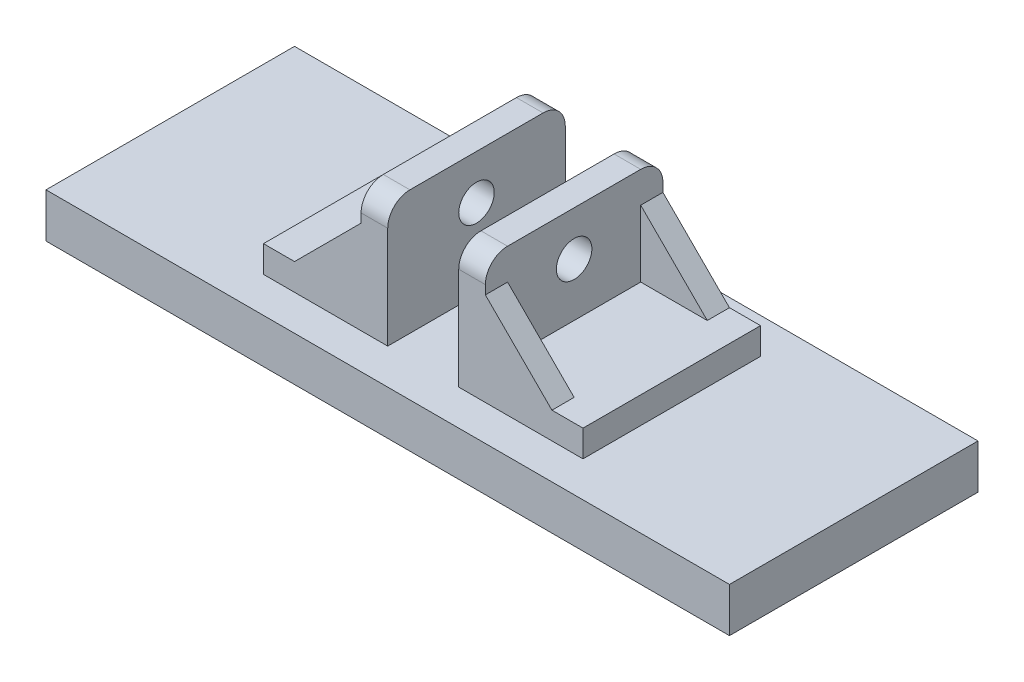
ISO-10303-21;
HEADER;
FILE_DESCRIPTION(('STEP AP214'),'2;1');
FILE_NAME('part.step','',(''),(''),'','','');
FILE_SCHEMA(('AUTOMOTIVE_DESIGN { 1 0 10303 214 1 1 1 1 }'));
ENDSEC;
DATA;
#1=APPLICATION_CONTEXT('core data for automotive mechanical design processes');
#2=APPLICATION_PROTOCOL_DEFINITION('international standard','automotive_design',2000,#1);
#3=PRODUCT_CONTEXT('',#1,'mechanical');
#4=PRODUCT('Part','Part','',(#3));
#5=PRODUCT_RELATED_PRODUCT_CATEGORY('part','',(#4));
#6=PRODUCT_DEFINITION_FORMATION('','',#4);
#7=PRODUCT_DEFINITION_CONTEXT('part definition',#1,'design');
#8=PRODUCT_DEFINITION('design','',#6,#7);
#9=PRODUCT_DEFINITION_SHAPE('','',#8);
#10=(LENGTH_UNIT() NAMED_UNIT(*) SI_UNIT(.MILLI.,.METRE.));
#11=(NAMED_UNIT(*) PLANE_ANGLE_UNIT() SI_UNIT($,.RADIAN.));
#12=(NAMED_UNIT(*) SI_UNIT($,.STERADIAN.) SOLID_ANGLE_UNIT());
#13=UNCERTAINTY_MEASURE_WITH_UNIT(LENGTH_MEASURE(1.E-05),#10,'distance_accuracy_value','');
#14=(GEOMETRIC_REPRESENTATION_CONTEXT(3) GLOBAL_UNCERTAINTY_ASSIGNED_CONTEXT((#13)) GLOBAL_UNIT_ASSIGNED_CONTEXT((#10,
#11,#12)) REPRESENTATION_CONTEXT('',''));
#15=CARTESIAN_POINT('',(0.,0.,0.));
#16=DIRECTION('',(0.,0.,1.));
#17=DIRECTION('',(1.,0.,0.));
#18=AXIS2_PLACEMENT_3D('',#15,#16,#17);
#19=CARTESIAN_POINT('',(-14.,38.,20.));
#20=DIRECTION('',(1.,0.,0.));
#21=DIRECTION('',(0.,1.,0.));
#22=AXIS2_PLACEMENT_3D('',#19,#20,#21);
#23=PLANE('',#22);
#24=CARTESIAN_POINT('',(-14.,28.,0.));
#25=DIRECTION('',(-1.,0.,0.));
#26=DIRECTION('',(0.,-1.,0.));
#27=AXIS2_PLACEMENT_3D('',#24,#25,#26);
#28=CIRCLE('',#27,4.);
#29=CARTESIAN_POINT('',(-14.,24.,0.));
#30=VERTEX_POINT('',#29);
#31=EDGE_CURVE('E832',#30,#30,#28,.T.);
#32=ORIENTED_EDGE('',*,*,#31,.F.);
#33=EDGE_LOOP('',(#32));
#34=FACE_BOUND('',#33,.T.);
#35=DIRECTION('',(0.,0.,-1.));
#36=VECTOR('',#35,1.);
#37=CARTESIAN_POINT('',(-14.,38.,20.));
#38=LINE('',#37,#36);
#39=CARTESIAN_POINT('',(-14.,38.,15.));
#40=VERTEX_POINT('',#39);
#41=CARTESIAN_POINT('',(-14.,38.,-15.));
#42=VERTEX_POINT('',#41);
#43=EDGE_CURVE('E369',#40,#42,#38,.T.);
#44=ORIENTED_EDGE('',*,*,#43,.T.);
#45=CARTESIAN_POINT('',(-14.,33.,-15.));
#46=DIRECTION('',(1.,0.,0.));
#47=DIRECTION('',(0.,1.,0.));
#48=AXIS2_PLACEMENT_3D('',#45,#46,#47);
#49=CIRCLE('',#48,5.);
#50=CARTESIAN_POINT('',(-14.,33.,-20.));
#51=VERTEX_POINT('',#50);
#52=EDGE_CURVE('E419',#42,#51,#49,.F.);
#53=ORIENTED_EDGE('',*,*,#52,.T.);
#54=DIRECTION('',(0.,-1.,0.));
#55=VECTOR('',#54,1.);
#56=CARTESIAN_POINT('',(-14.,38.,-20.));
#57=LINE('',#56,#55);
#58=CARTESIAN_POINT('',(-14.,31.0000000000001,-20.));
#59=VERTEX_POINT('',#58);
#60=EDGE_CURVE('E357',#51,#59,#57,.T.);
#61=ORIENTED_EDGE('',*,*,#60,.T.);
#62=DIRECTION('',(0.,0.,1.));
#63=VECTOR('',#62,1.);
#64=CARTESIAN_POINT('',(-14.,31.0000000000001,-20.));
#65=LINE('',#64,#63);
#66=CARTESIAN_POINT('',(-14.,31.0000000000001,-15.));
#67=VERTEX_POINT('',#66);
#68=EDGE_CURVE('E292',#59,#67,#65,.T.);
#69=ORIENTED_EDGE('',*,*,#68,.T.);
#70=DIRECTION('',(0.,-1.,0.));
#71=VECTOR('',#70,1.);
#72=CARTESIAN_POINT('',(-14.,0.,-15.));
#73=LINE('',#72,#71);
#74=CARTESIAN_POINT('',(-14.,16.,-15.));
#75=VERTEX_POINT('',#74);
#76=EDGE_CURVE('E287',#67,#75,#73,.T.);
#77=ORIENTED_EDGE('',*,*,#76,.T.);
#78=DIRECTION('',(0.,0.,-1.));
#79=VECTOR('',#78,1.);
#80=CARTESIAN_POINT('',(-14.,16.,20.));
#81=LINE('',#80,#79);
#82=CARTESIAN_POINT('',(-14.,16.,15.));
#83=VERTEX_POINT('',#82);
#84=EDGE_CURVE('E367',#83,#75,#81,.T.);
#85=ORIENTED_EDGE('',*,*,#84,.F.);
#86=DIRECTION('',(0.,-1.,0.));
#87=VECTOR('',#86,1.);
#88=CARTESIAN_POINT('',(-14.,0.,15.));
#89=LINE('',#88,#87);
#90=CARTESIAN_POINT('',(-14.,31.0000000000001,15.));
#91=VERTEX_POINT('',#90);
#92=EDGE_CURVE('E258',#91,#83,#89,.T.);
#93=ORIENTED_EDGE('',*,*,#92,.F.);
#94=DIRECTION('',(0.,0.,-1.));
#95=VECTOR('',#94,1.);
#96=CARTESIAN_POINT('',(-14.,31.0000000000001,20.));
#97=LINE('',#96,#95);
#98=CARTESIAN_POINT('',(-14.,31.0000000000001,20.));
#99=VERTEX_POINT('',#98);
#100=EDGE_CURVE('E271',#99,#91,#97,.T.);
#101=ORIENTED_EDGE('',*,*,#100,.F.);
#102=DIRECTION('',(0.,-1.,0.));
#103=VECTOR('',#102,1.);
#104=CARTESIAN_POINT('',(-14.,38.,20.));
#105=LINE('',#104,#103);
#106=CARTESIAN_POINT('',(-14.,33.,20.));
#107=VERTEX_POINT('',#106);
#108=EDGE_CURVE('E345',#107,#99,#105,.T.);
#109=ORIENTED_EDGE('',*,*,#108,.F.);
#110=CARTESIAN_POINT('',(-14.,33.,15.));
#111=DIRECTION('',(1.,0.,0.));
#112=DIRECTION('',(0.,1.,0.));
#113=AXIS2_PLACEMENT_3D('',#110,#111,#112);
#114=CIRCLE('',#113,5.);
#115=EDGE_CURVE('E417',#107,#40,#114,.F.);
#116=ORIENTED_EDGE('',*,*,#115,.T.);
#117=EDGE_LOOP('',(#44,#53,#61,#69,#77,#85,#93,#101,#109,#116));
#118=FACE_BOUND('',#117,.T.);
#119=ADVANCED_FACE('F35',(#34,#118),#23,.F.);
#120=CARTESIAN_POINT('',(-14.,16.,20.));
#121=DIRECTION('',(0.,-1.,0.));
#122=DIRECTION('',(0.,0.,-1.));
#123=AXIS2_PLACEMENT_3D('',#120,#121,#122);
#124=PLANE('',#123);
#125=DIRECTION('',(0.,0.,-1.));
#126=VECTOR('',#125,1.);
#127=CARTESIAN_POINT('',(-29.,16.,20.));
#128=LINE('',#127,#126);
#129=CARTESIAN_POINT('',(-29.,16.,20.));
#130=VERTEX_POINT('',#129);
#131=CARTESIAN_POINT('',(-29.,16.,15.));
#132=VERTEX_POINT('',#131);
#133=EDGE_CURVE('E262',#130,#132,#128,.T.);
#134=ORIENTED_EDGE('',*,*,#133,.T.);
#135=DIRECTION('',(-1.,0.,0.));
#136=VECTOR('',#135,1.);
#137=CARTESIAN_POINT('',(0.,16.,15.));
#138=LINE('',#137,#136);
#139=EDGE_CURVE('E263',#83,#132,#138,.T.);
#140=ORIENTED_EDGE('',*,*,#139,.F.);
#141=ORIENTED_EDGE('',*,*,#84,.T.);
#142=DIRECTION('',(-1.,0.,0.));
#143=VECTOR('',#142,1.);
#144=CARTESIAN_POINT('',(0.,16.,-15.));
#145=LINE('',#144,#143);
#146=CARTESIAN_POINT('',(-29.,16.,-15.));
#147=VERTEX_POINT('',#146);
#148=EDGE_CURVE('E293',#75,#147,#145,.T.);
#149=ORIENTED_EDGE('',*,*,#148,.T.);
#150=DIRECTION('',(0.,0.,1.));
#151=VECTOR('',#150,1.);
#152=CARTESIAN_POINT('',(-29.,16.,-20.));
#153=LINE('',#152,#151);
#154=CARTESIAN_POINT('',(-29.,16.,-20.));
#155=VERTEX_POINT('',#154);
#156=EDGE_CURVE('E300',#155,#147,#153,.T.);
#157=ORIENTED_EDGE('',*,*,#156,.F.);
#158=DIRECTION('',(-1.,0.,0.));
#159=VECTOR('',#158,1.);
#160=CARTESIAN_POINT('',(-14.,16.,-20.));
#161=LINE('',#160,#159);
#162=CARTESIAN_POINT('',(-36.,16.,-20.));
#163=VERTEX_POINT('',#162);
#164=EDGE_CURVE('E359',#155,#163,#161,.T.);
#165=ORIENTED_EDGE('',*,*,#164,.T.);
#166=DIRECTION('',(0.,0.,-1.));
#167=VECTOR('',#166,1.);
#168=CARTESIAN_POINT('',(-36.,16.,20.));
#169=LINE('',#168,#167);
#170=CARTESIAN_POINT('',(-36.,16.,20.));
#171=VERTEX_POINT('',#170);
#172=EDGE_CURVE('E364',#171,#163,#169,.T.);
#173=ORIENTED_EDGE('',*,*,#172,.F.);
#174=DIRECTION('',(-1.,0.,0.));
#175=VECTOR('',#174,1.);
#176=CARTESIAN_POINT('',(-14.,16.,20.));
#177=LINE('',#176,#175);
#178=EDGE_CURVE('E347',#130,#171,#177,.T.);
#179=ORIENTED_EDGE('',*,*,#178,.F.);
#180=EDGE_LOOP('',(#134,#140,#141,#149,#157,#165,#173,#179));
#181=FACE_BOUND('',#180,.T.);
#182=ADVANCED_FACE('F491',(#181),#124,.F.);
#183=CARTESIAN_POINT('',(14.,16.,20.));
#184=DIRECTION('',(0.,1.,0.));
#185=DIRECTION('',(0.,0.,1.));
#186=AXIS2_PLACEMENT_3D('',#183,#184,#185);
#187=PLANE('',#186);
#188=DIRECTION('',(0.,0.,-1.));
#189=VECTOR('',#188,1.);
#190=CARTESIAN_POINT('',(29.,16.,20.));
#191=LINE('',#190,#189);
#192=CARTESIAN_POINT('',(29.,16.,20.));
#193=VERTEX_POINT('',#192);
#194=CARTESIAN_POINT('',(29.,16.,15.));
#195=VERTEX_POINT('',#194);
#196=EDGE_CURVE('E235',#193,#195,#191,.T.);
#197=ORIENTED_EDGE('',*,*,#196,.F.);
#198=DIRECTION('',(1.,0.,0.));
#199=VECTOR('',#198,1.);
#200=CARTESIAN_POINT('',(14.,16.,20.));
#201=LINE('',#200,#199);
#202=CARTESIAN_POINT('',(36.,16.,20.));
#203=VERTEX_POINT('',#202);
#204=EDGE_CURVE('E222',#193,#203,#201,.T.);
#205=ORIENTED_EDGE('',*,*,#204,.T.);
#206=DIRECTION('',(0.,0.,-1.));
#207=VECTOR('',#206,1.);
#208=CARTESIAN_POINT('',(36.,16.,20.));
#209=LINE('',#208,#207);
#210=CARTESIAN_POINT('',(36.,16.,-20.));
#211=VERTEX_POINT('',#210);
#212=EDGE_CURVE('E305',#203,#211,#209,.T.);
#213=ORIENTED_EDGE('',*,*,#212,.T.);
#214=DIRECTION('',(1.,0.,0.));
#215=VECTOR('',#214,1.);
#216=CARTESIAN_POINT('',(14.,16.,-20.));
#217=LINE('',#216,#215);
#218=CARTESIAN_POINT('',(29.,16.,-20.));
#219=VERTEX_POINT('',#218);
#220=EDGE_CURVE('E328',#219,#211,#217,.T.);
#221=ORIENTED_EDGE('',*,*,#220,.F.);
#222=DIRECTION('',(0.,0.,1.));
#223=VECTOR('',#222,1.);
#224=CARTESIAN_POINT('',(29.,16.,-20.));
#225=LINE('',#224,#223);
#226=CARTESIAN_POINT('',(29.,16.,-15.));
#227=VERTEX_POINT('',#226);
#228=EDGE_CURVE('E284',#219,#227,#225,.T.);
#229=ORIENTED_EDGE('',*,*,#228,.T.);
#230=DIRECTION('',(1.,0.,0.));
#231=VECTOR('',#230,1.);
#232=CARTESIAN_POINT('',(0.,16.,-15.));
#233=LINE('',#232,#231);
#234=CARTESIAN_POINT('',(14.,16.,-15.));
#235=VERTEX_POINT('',#234);
#236=EDGE_CURVE('E277',#235,#227,#233,.T.);
#237=ORIENTED_EDGE('',*,*,#236,.F.);
#238=DIRECTION('',(0.,0.,-1.));
#239=VECTOR('',#238,1.);
#240=CARTESIAN_POINT('',(14.,16.,20.));
#241=LINE('',#240,#239);
#242=CARTESIAN_POINT('',(14.,16.,15.));
#243=VERTEX_POINT('',#242);
#244=EDGE_CURVE('E303',#243,#235,#241,.T.);
#245=ORIENTED_EDGE('',*,*,#244,.F.);
#246=DIRECTION('',(1.,0.,0.));
#247=VECTOR('',#246,1.);
#248=CARTESIAN_POINT('',(0.,16.,15.));
#249=LINE('',#248,#247);
#250=EDGE_CURVE('E239',#243,#195,#249,.T.);
#251=ORIENTED_EDGE('',*,*,#250,.T.);
#252=EDGE_LOOP('',(#197,#205,#213,#221,#229,#237,#245,#251));
#253=FACE_BOUND('',#252,.T.);
#254=ADVANCED_FACE('F236',(#253),#187,.T.);
#255=CARTESIAN_POINT('',(14.,38.,20.));
#256=DIRECTION('',(1.,0.,0.));
#257=DIRECTION('',(0.,1.,0.));
#258=AXIS2_PLACEMENT_3D('',#255,#256,#257);
#259=PLANE('',#258);
#260=CARTESIAN_POINT('',(14.,28.,0.));
#261=DIRECTION('',(1.,0.,0.));
#262=DIRECTION('',(0.,1.,0.));
#263=AXIS2_PLACEMENT_3D('',#260,#261,#262);
#264=CIRCLE('',#263,4.);
#265=CARTESIAN_POINT('',(14.,32.,0.));
#266=VERTEX_POINT('',#265);
#267=EDGE_CURVE('E412',#266,#266,#264,.F.);
#268=ORIENTED_EDGE('',*,*,#267,.T.);
#269=EDGE_LOOP('',(#268));
#270=FACE_BOUND('',#269,.T.);
#271=DIRECTION('',(0.,0.,-1.));
#272=VECTOR('',#271,1.);
#273=CARTESIAN_POINT('',(14.,38.,20.));
#274=LINE('',#273,#272);
#275=CARTESIAN_POINT('',(14.,38.,15.));
#276=VERTEX_POINT('',#275);
#277=CARTESIAN_POINT('',(14.,38.,-15.));
#278=VERTEX_POINT('',#277);
#279=EDGE_CURVE('E316',#276,#278,#274,.T.);
#280=ORIENTED_EDGE('',*,*,#279,.F.);
#281=CARTESIAN_POINT('',(14.,33.,15.));
#282=DIRECTION('',(1.,0.,0.));
#283=DIRECTION('',(0.,1.,0.));
#284=AXIS2_PLACEMENT_3D('',#281,#282,#283);
#285=CIRCLE('',#284,5.);
#286=CARTESIAN_POINT('',(14.,33.,20.));
#287=VERTEX_POINT('',#286);
#288=EDGE_CURVE('E434',#276,#287,#285,.T.);
#289=ORIENTED_EDGE('',*,*,#288,.T.);
#290=DIRECTION('',(0.,-1.,0.));
#291=VECTOR('',#290,1.);
#292=CARTESIAN_POINT('',(14.,38.,20.));
#293=LINE('',#292,#291);
#294=CARTESIAN_POINT('',(14.,31.0000000000001,20.));
#295=VERTEX_POINT('',#294);
#296=EDGE_CURVE('E307',#287,#295,#293,.T.);
#297=ORIENTED_EDGE('',*,*,#296,.T.);
#298=DIRECTION('',(0.,0.,-1.));
#299=VECTOR('',#298,1.);
#300=CARTESIAN_POINT('',(14.,31.0000000000001,20.));
#301=LINE('',#300,#299);
#302=CARTESIAN_POINT('',(14.,31.0000000000001,15.));
#303=VERTEX_POINT('',#302);
#304=EDGE_CURVE('E243',#295,#303,#301,.T.);
#305=ORIENTED_EDGE('',*,*,#304,.T.);
#306=DIRECTION('',(0.,-1.,0.));
#307=VECTOR('',#306,1.);
#308=CARTESIAN_POINT('',(14.,0.,15.));
#309=LINE('',#308,#307);
#310=EDGE_CURVE('E248',#303,#243,#309,.T.);
#311=ORIENTED_EDGE('',*,*,#310,.T.);
#312=ORIENTED_EDGE('',*,*,#244,.T.);
#313=DIRECTION('',(0.,-1.,0.));
#314=VECTOR('',#313,1.);
#315=CARTESIAN_POINT('',(14.,0.,-15.));
#316=LINE('',#315,#314);
#317=CARTESIAN_POINT('',(14.,31.0000000000001,-15.));
#318=VERTEX_POINT('',#317);
#319=EDGE_CURVE('E279',#318,#235,#316,.T.);
#320=ORIENTED_EDGE('',*,*,#319,.F.);
#321=DIRECTION('',(0.,0.,1.));
#322=VECTOR('',#321,1.);
#323=CARTESIAN_POINT('',(14.,31.0000000000001,-20.));
#324=LINE('',#323,#322);
#325=CARTESIAN_POINT('',(14.,31.0000000000001,-20.));
#326=VERTEX_POINT('',#325);
#327=EDGE_CURVE('E276',#326,#318,#324,.T.);
#328=ORIENTED_EDGE('',*,*,#327,.F.);
#329=DIRECTION('',(0.,-1.,0.));
#330=VECTOR('',#329,1.);
#331=CARTESIAN_POINT('',(14.,38.,-20.));
#332=LINE('',#331,#330);
#333=CARTESIAN_POINT('',(14.,33.,-20.));
#334=VERTEX_POINT('',#333);
#335=EDGE_CURVE('E232',#334,#326,#332,.T.);
#336=ORIENTED_EDGE('',*,*,#335,.F.);
#337=CARTESIAN_POINT('',(14.,33.,-15.));
#338=DIRECTION('',(1.,0.,0.));
#339=DIRECTION('',(0.,1.,0.));
#340=AXIS2_PLACEMENT_3D('',#337,#338,#339);
#341=CIRCLE('',#340,5.);
#342=EDGE_CURVE('E432',#334,#278,#341,.T.);
#343=ORIENTED_EDGE('',*,*,#342,.T.);
#344=EDGE_LOOP('',(#280,#289,#297,#305,#311,#312,#320,#328,#336,#343));
#345=FACE_BOUND('',#344,.T.);
#346=ADVANCED_FACE('F449',(#270,#345),#259,.T.);
#347=CARTESIAN_POINT('',(0.,10.,0.));
#348=DIRECTION('',(0.,-1.,0.));
#349=DIRECTION('',(0.,0.,-1.));
#350=AXIS2_PLACEMENT_3D('',#347,#348,#349);
#351=PLANE('',#350);
#352=DIRECTION('',(0.,0.,1.));
#353=VECTOR('',#352,1.);
#354=CARTESIAN_POINT('',(-77.,10.,-28.));
#355=LINE('',#354,#353);
#356=CARTESIAN_POINT('',(-77.,10.,-28.));
#357=VERTEX_POINT('',#356);
#358=CARTESIAN_POINT('',(-77.,10.,28.));
#359=VERTEX_POINT('',#358);
#360=EDGE_CURVE('E379',#357,#359,#355,.T.);
#361=ORIENTED_EDGE('',*,*,#360,.T.);
#362=DIRECTION('',(1.,0.,0.));
#363=VECTOR('',#362,1.);
#364=CARTESIAN_POINT('',(77.,10.,28.));
#365=LINE('',#364,#363);
#366=CARTESIAN_POINT('',(77.,10.,28.));
#367=VERTEX_POINT('',#366);
#368=EDGE_CURVE('E382',#359,#367,#365,.T.);
#369=ORIENTED_EDGE('',*,*,#368,.T.);
#370=DIRECTION('',(0.,0.,-1.));
#371=VECTOR('',#370,1.);
#372=CARTESIAN_POINT('',(77.,10.,-28.));
#373=LINE('',#372,#371);
#374=CARTESIAN_POINT('',(77.,10.,-28.));
#375=VERTEX_POINT('',#374);
#376=EDGE_CURVE('E385',#367,#375,#373,.T.);
#377=ORIENTED_EDGE('',*,*,#376,.T.);
#378=DIRECTION('',(-1.,0.,0.));
#379=VECTOR('',#378,1.);
#380=CARTESIAN_POINT('',(77.,10.,-28.));
#381=LINE('',#380,#379);
#382=EDGE_CURVE('E387',#375,#357,#381,.T.);
#383=ORIENTED_EDGE('',*,*,#382,.T.);
#384=EDGE_LOOP('',(#361,#369,#377,#383));
#385=FACE_BOUND('',#384,.T.);
#386=DIRECTION('',(0.,0.,-1.));
#387=VECTOR('',#386,1.);
#388=CARTESIAN_POINT('',(-8.,10.,20.));
#389=LINE('',#388,#387);
#390=CARTESIAN_POINT('',(-8.,10.,20.));
#391=VERTEX_POINT('',#390);
#392=CARTESIAN_POINT('',(-8.,10.,-20.));
#393=VERTEX_POINT('',#392);
#394=EDGE_CURVE('E375',#391,#393,#389,.T.);
#395=ORIENTED_EDGE('',*,*,#394,.F.);
#396=DIRECTION('',(1.,0.,0.));
#397=VECTOR('',#396,1.);
#398=CARTESIAN_POINT('',(-36.,10.,20.));
#399=LINE('',#398,#397);
#400=CARTESIAN_POINT('',(-36.,10.,20.));
#401=VERTEX_POINT('',#400);
#402=EDGE_CURVE('E338',#401,#391,#399,.T.);
#403=ORIENTED_EDGE('',*,*,#402,.F.);
#404=DIRECTION('',(0.,0.,-1.));
#405=VECTOR('',#404,1.);
#406=CARTESIAN_POINT('',(-36.,10.,20.));
#407=LINE('',#406,#405);
#408=CARTESIAN_POINT('',(-36.,10.,-20.));
#409=VERTEX_POINT('',#408);
#410=EDGE_CURVE('E352',#401,#409,#407,.T.);
#411=ORIENTED_EDGE('',*,*,#410,.T.);
#412=DIRECTION('',(1.,0.,0.));
#413=VECTOR('',#412,1.);
#414=CARTESIAN_POINT('',(-36.,10.,-20.));
#415=LINE('',#414,#413);
#416=EDGE_CURVE('E330',#409,#393,#415,.T.);
#417=ORIENTED_EDGE('',*,*,#416,.T.);
#418=EDGE_LOOP('',(#395,#403,#411,#417));
#419=FACE_BOUND('',#418,.T.);
#420=DIRECTION('',(-1.,0.,0.));
#421=VECTOR('',#420,1.);
#422=CARTESIAN_POINT('',(36.,10.,20.));
#423=LINE('',#422,#421);
#424=CARTESIAN_POINT('',(36.,10.,20.));
#425=VERTEX_POINT('',#424);
#426=CARTESIAN_POINT('',(8.,10.,20.));
#427=VERTEX_POINT('',#426);
#428=EDGE_CURVE('E334',#425,#427,#423,.T.);
#429=ORIENTED_EDGE('',*,*,#428,.T.);
#430=DIRECTION('',(0.,0.,-1.));
#431=VECTOR('',#430,1.);
#432=CARTESIAN_POINT('',(8.,10.,20.));
#433=LINE('',#432,#431);
#434=CARTESIAN_POINT('',(8.,10.,-20.));
#435=VERTEX_POINT('',#434);
#436=EDGE_CURVE('E311',#427,#435,#433,.T.);
#437=ORIENTED_EDGE('',*,*,#436,.T.);
#438=DIRECTION('',(-1.,0.,0.));
#439=VECTOR('',#438,1.);
#440=CARTESIAN_POINT('',(36.,10.,-20.));
#441=LINE('',#440,#439);
#442=CARTESIAN_POINT('',(36.,10.,-20.));
#443=VERTEX_POINT('',#442);
#444=EDGE_CURVE('E323',#443,#435,#441,.T.);
#445=ORIENTED_EDGE('',*,*,#444,.F.);
#446=DIRECTION('',(0.,0.,-1.));
#447=VECTOR('',#446,1.);
#448=CARTESIAN_POINT('',(36.,10.,20.));
#449=LINE('',#448,#447);
#450=EDGE_CURVE('E308',#425,#443,#449,.T.);
#451=ORIENTED_EDGE('',*,*,#450,.F.);
#452=EDGE_LOOP('',(#429,#437,#445,#451));
#453=FACE_BOUND('',#452,.T.);
#454=ADVANCED_FACE('F465',(#385,#419,#453),#351,.F.);
#455=CARTESIAN_POINT('',(-77.,10.,-28.));
#456=DIRECTION('',(1.,0.,0.));
#457=DIRECTION('',(0.,0.,-1.));
#458=AXIS2_PLACEMENT_3D('',#455,#456,#457);
#459=PLANE('',#458);
#460=DIRECTION('',(0.,0.,1.));
#461=VECTOR('',#460,1.);
#462=CARTESIAN_POINT('',(-77.,0.,-28.));
#463=LINE('',#462,#461);
#464=CARTESIAN_POINT('',(-77.,0.,-28.));
#465=VERTEX_POINT('',#464);
#466=CARTESIAN_POINT('',(-77.,0.,28.));
#467=VERTEX_POINT('',#466);
#468=EDGE_CURVE('E378',#465,#467,#463,.T.);
#469=ORIENTED_EDGE('',*,*,#468,.T.);
#470=DIRECTION('',(0.,-1.,0.));
#471=VECTOR('',#470,1.);
#472=CARTESIAN_POINT('',(-77.,10.,28.));
#473=LINE('',#472,#471);
#474=EDGE_CURVE('E405',#359,#467,#473,.T.);
#475=ORIENTED_EDGE('',*,*,#474,.F.);
#476=ORIENTED_EDGE('',*,*,#360,.F.);
#477=DIRECTION('',(0.,-1.,0.));
#478=VECTOR('',#477,1.);
#479=CARTESIAN_POINT('',(-77.,10.,-28.));
#480=LINE('',#479,#478);
#481=EDGE_CURVE('E389',#357,#465,#480,.T.);
#482=ORIENTED_EDGE('',*,*,#481,.T.);
#483=EDGE_LOOP('',(#469,#475,#476,#482));
#484=FACE_BOUND('',#483,.T.);
#485=ADVANCED_FACE('F515',(#484),#459,.F.);
#486=CARTESIAN_POINT('',(77.,10.,28.));
#487=DIRECTION('',(0.,0.,-1.));
#488=DIRECTION('',(-1.,0.,0.));
#489=AXIS2_PLACEMENT_3D('',#486,#487,#488);
#490=PLANE('',#489);
#491=DIRECTION('',(1.,0.,0.));
#492=VECTOR('',#491,1.);
#493=CARTESIAN_POINT('',(77.,0.,28.));
#494=LINE('',#493,#492);
#495=CARTESIAN_POINT('',(77.,0.,28.));
#496=VERTEX_POINT('',#495);
#497=EDGE_CURVE('E392',#467,#496,#494,.T.);
#498=ORIENTED_EDGE('',*,*,#497,.T.);
#499=DIRECTION('',(0.,-1.,0.));
#500=VECTOR('',#499,1.);
#501=CARTESIAN_POINT('',(77.,10.,28.));
#502=LINE('',#501,#500);
#503=EDGE_CURVE('E402',#367,#496,#502,.T.);
#504=ORIENTED_EDGE('',*,*,#503,.F.);
#505=ORIENTED_EDGE('',*,*,#368,.F.);
#506=ORIENTED_EDGE('',*,*,#474,.T.);
#507=EDGE_LOOP('',(#498,#504,#505,#506));
#508=FACE_BOUND('',#507,.T.);
#509=ADVANCED_FACE('F527',(#508),#490,.F.);
#510=CARTESIAN_POINT('',(77.,10.,-28.));
#511=DIRECTION('',(-1.,0.,0.));
#512=DIRECTION('',(0.,0.,1.));
#513=AXIS2_PLACEMENT_3D('',#510,#511,#512);
#514=PLANE('',#513);
#515=DIRECTION('',(0.,0.,-1.));
#516=VECTOR('',#515,1.);
#517=CARTESIAN_POINT('',(77.,0.,-28.));
#518=LINE('',#517,#516);
#519=CARTESIAN_POINT('',(77.,0.,-28.));
#520=VERTEX_POINT('',#519);
#521=EDGE_CURVE('E394',#496,#520,#518,.T.);
#522=ORIENTED_EDGE('',*,*,#521,.T.);
#523=DIRECTION('',(0.,-1.,0.));
#524=VECTOR('',#523,1.);
#525=CARTESIAN_POINT('',(77.,10.,-28.));
#526=LINE('',#525,#524);
#527=EDGE_CURVE('E399',#375,#520,#526,.T.);
#528=ORIENTED_EDGE('',*,*,#527,.F.);
#529=ORIENTED_EDGE('',*,*,#376,.F.);
#530=ORIENTED_EDGE('',*,*,#503,.T.);
#531=EDGE_LOOP('',(#522,#528,#529,#530));
#532=FACE_BOUND('',#531,.T.);
#533=ADVANCED_FACE('F523',(#532),#514,.F.);
#534=CARTESIAN_POINT('',(77.,10.,-28.));
#535=DIRECTION('',(0.,0.,1.));
#536=DIRECTION('',(1.,0.,0.));
#537=AXIS2_PLACEMENT_3D('',#534,#535,#536);
#538=PLANE('',#537);
#539=DIRECTION('',(-1.,0.,0.));
#540=VECTOR('',#539,1.);
#541=CARTESIAN_POINT('',(77.,0.,-28.));
#542=LINE('',#541,#540);
#543=EDGE_CURVE('E383',#520,#465,#542,.T.);
#544=ORIENTED_EDGE('',*,*,#543,.T.);
#545=ORIENTED_EDGE('',*,*,#481,.F.);
#546=ORIENTED_EDGE('',*,*,#382,.F.);
#547=ORIENTED_EDGE('',*,*,#527,.T.);
#548=EDGE_LOOP('',(#544,#545,#546,#547));
#549=FACE_BOUND('',#548,.T.);
#550=ADVANCED_FACE('F519',(#549),#538,.F.);
#551=CARTESIAN_POINT('',(0.,0.,0.));
#552=DIRECTION('',(0.,-1.,0.));
#553=DIRECTION('',(0.,0.,-1.));
#554=AXIS2_PLACEMENT_3D('',#551,#552,#553);
#555=PLANE('',#554);
#556=ORIENTED_EDGE('',*,*,#468,.F.);
#557=ORIENTED_EDGE('',*,*,#543,.F.);
#558=ORIENTED_EDGE('',*,*,#521,.F.);
#559=ORIENTED_EDGE('',*,*,#497,.F.);
#560=EDGE_LOOP('',(#556,#557,#558,#559));
#561=FACE_BOUND('',#560,.T.);
#562=ADVANCED_FACE('F511',(#561),#555,.T.);
#563=CARTESIAN_POINT('',(-8.,10.,20.));
#564=DIRECTION('',(-1.,0.,0.));
#565=DIRECTION('',(0.,0.,1.));
#566=AXIS2_PLACEMENT_3D('',#563,#564,#565);
#567=PLANE('',#566);
#568=CARTESIAN_POINT('',(-8.,28.,0.));
#569=DIRECTION('',(-1.,0.,0.));
#570=DIRECTION('',(0.,0.,1.));
#571=AXIS2_PLACEMENT_3D('',#568,#569,#570);
#572=CIRCLE('',#571,4.);
#573=CARTESIAN_POINT('',(-8.,28.,4.));
#574=VERTEX_POINT('',#573);
#575=EDGE_CURVE('E252',#574,#574,#572,.T.);
#576=ORIENTED_EDGE('',*,*,#575,.T.);
#577=EDGE_LOOP('',(#576));
#578=FACE_BOUND('',#577,.T.);
#579=DIRECTION('',(0.,1.,0.));
#580=VECTOR('',#579,1.);
#581=CARTESIAN_POINT('',(-8.,10.,-20.));
#582=LINE('',#581,#580);
#583=CARTESIAN_POINT('',(-8.,33.,-20.));
#584=VERTEX_POINT('',#583);
#585=EDGE_CURVE('E354',#393,#584,#582,.T.);
#586=ORIENTED_EDGE('',*,*,#585,.T.);
#587=CARTESIAN_POINT('',(-8.,33.,-15.));
#588=DIRECTION('',(-1.,0.,0.));
#589=DIRECTION('',(0.,0.,1.));
#590=AXIS2_PLACEMENT_3D('',#587,#588,#589);
#591=CIRCLE('',#590,5.);
#592=CARTESIAN_POINT('',(-8.,38.,-15.));
#593=VERTEX_POINT('',#592);
#594=EDGE_CURVE('E425',#584,#593,#591,.F.);
#595=ORIENTED_EDGE('',*,*,#594,.T.);
#596=DIRECTION('',(0.,0.,-1.));
#597=VECTOR('',#596,1.);
#598=CARTESIAN_POINT('',(-8.,38.,20.));
#599=LINE('',#598,#597);
#600=CARTESIAN_POINT('',(-8.,38.,15.));
#601=VERTEX_POINT('',#600);
#602=EDGE_CURVE('E372',#601,#593,#599,.T.);
#603=ORIENTED_EDGE('',*,*,#602,.F.);
#604=CARTESIAN_POINT('',(-8.,33.,15.));
#605=DIRECTION('',(-1.,0.,0.));
#606=DIRECTION('',(0.,0.,1.));
#607=AXIS2_PLACEMENT_3D('',#604,#605,#606);
#608=CIRCLE('',#607,5.);
#609=CARTESIAN_POINT('',(-8.,33.,20.));
#610=VERTEX_POINT('',#609);
#611=EDGE_CURVE('E423',#601,#610,#608,.F.);
#612=ORIENTED_EDGE('',*,*,#611,.T.);
#613=DIRECTION('',(0.,1.,0.));
#614=VECTOR('',#613,1.);
#615=CARTESIAN_POINT('',(-8.,10.,20.));
#616=LINE('',#615,#614);
#617=EDGE_CURVE('E341',#391,#610,#616,.T.);
#618=ORIENTED_EDGE('',*,*,#617,.F.);
#619=ORIENTED_EDGE('',*,*,#394,.T.);
#620=EDGE_LOOP('',(#586,#595,#603,#612,#618,#619));
#621=FACE_BOUND('',#620,.T.);
#622=ADVANCED_FACE('F507',(#578,#621),#567,.F.);
#623=CARTESIAN_POINT('',(-8.,38.,20.));
#624=DIRECTION('',(0.,-1.,0.));
#625=DIRECTION('',(0.,0.,-1.));
#626=AXIS2_PLACEMENT_3D('',#623,#624,#625);
#627=PLANE('',#626);
#628=ORIENTED_EDGE('',*,*,#602,.T.);
#629=DIRECTION('',(-1.,0.,0.));
#630=VECTOR('',#629,1.);
#631=CARTESIAN_POINT('',(-8.,38.,-15.));
#632=LINE('',#631,#630);
#633=EDGE_CURVE('E414',#593,#42,#632,.T.);
#634=ORIENTED_EDGE('',*,*,#633,.T.);
#635=ORIENTED_EDGE('',*,*,#43,.F.);
#636=DIRECTION('',(-1.,0.,0.));
#637=VECTOR('',#636,1.);
#638=CARTESIAN_POINT('',(-8.,38.,15.));
#639=LINE('',#638,#637);
#640=EDGE_CURVE('E408',#40,#601,#639,.F.);
#641=ORIENTED_EDGE('',*,*,#640,.T.);
#642=EDGE_LOOP('',(#628,#634,#635,#641));
#643=FACE_BOUND('',#642,.T.);
#644=ADVANCED_FACE('F503',(#643),#627,.F.);
#645=CARTESIAN_POINT('',(-36.,16.,20.));
#646=DIRECTION('',(1.,0.,0.));
#647=DIRECTION('',(0.,0.,-1.));
#648=AXIS2_PLACEMENT_3D('',#645,#646,#647);
#649=PLANE('',#648);
#650=DIRECTION('',(0.,-1.,0.));
#651=VECTOR('',#650,1.);
#652=CARTESIAN_POINT('',(-36.,16.,-20.));
#653=LINE('',#652,#651);
#654=EDGE_CURVE('E342',#163,#409,#653,.T.);
#655=ORIENTED_EDGE('',*,*,#654,.T.);
#656=ORIENTED_EDGE('',*,*,#410,.F.);
#657=DIRECTION('',(0.,-1.,0.));
#658=VECTOR('',#657,1.);
#659=CARTESIAN_POINT('',(-36.,16.,20.));
#660=LINE('',#659,#658);
#661=EDGE_CURVE('E349',#171,#401,#660,.T.);
#662=ORIENTED_EDGE('',*,*,#661,.F.);
#663=ORIENTED_EDGE('',*,*,#172,.T.);
#664=EDGE_LOOP('',(#655,#656,#662,#663));
#665=FACE_BOUND('',#664,.T.);
#666=ADVANCED_FACE('F506',(#665),#649,.F.);
#667=CARTESIAN_POINT('',(0.,0.,20.));
#668=DIRECTION('',(0.,0.,1.));
#669=DIRECTION('',(1.,0.,0.));
#670=AXIS2_PLACEMENT_3D('',#667,#668,#669);
#671=PLANE('',#670);
#672=ORIENTED_EDGE('',*,*,#617,.T.);
#673=DIRECTION('',(-1.,0.,0.));
#674=VECTOR('',#673,1.);
#675=CARTESIAN_POINT('',(-14.,33.,20.));
#676=LINE('',#675,#674);
#677=EDGE_CURVE('E11',#610,#107,#676,.T.);
#678=ORIENTED_EDGE('',*,*,#677,.T.);
#679=ORIENTED_EDGE('',*,*,#108,.T.);
#680=DIRECTION('',(-0.707106781186546,-0.707106781186549,0.));
#681=VECTOR('',#680,1.);
#682=CARTESIAN_POINT('',(-22.5000000000001,22.5,20.));
#683=LINE('',#682,#681);
#684=EDGE_CURVE('E259',#99,#130,#683,.T.);
#685=ORIENTED_EDGE('',*,*,#684,.T.);
#686=ORIENTED_EDGE('',*,*,#178,.T.);
#687=ORIENTED_EDGE('',*,*,#661,.T.);
#688=ORIENTED_EDGE('',*,*,#402,.T.);
#689=EDGE_LOOP('',(#672,#678,#679,#685,#686,#687,#688));
#690=FACE_BOUND('',#689,.T.);
#691=ADVANCED_FACE('F555',(#690),#671,.T.);
#692=CARTESIAN_POINT('',(0.,0.,-20.));
#693=DIRECTION('',(0.,0.,1.));
#694=DIRECTION('',(1.,0.,0.));
#695=AXIS2_PLACEMENT_3D('',#692,#693,#694);
#696=PLANE('',#695);
#697=ORIENTED_EDGE('',*,*,#60,.F.);
#698=DIRECTION('',(-1.,0.,0.));
#699=VECTOR('',#698,1.);
#700=CARTESIAN_POINT('',(0.,33.,-20.));
#701=LINE('',#700,#699);
#702=EDGE_CURVE('E421',#51,#584,#701,.F.);
#703=ORIENTED_EDGE('',*,*,#702,.T.);
#704=ORIENTED_EDGE('',*,*,#585,.F.);
#705=ORIENTED_EDGE('',*,*,#416,.F.);
#706=ORIENTED_EDGE('',*,*,#654,.F.);
#707=ORIENTED_EDGE('',*,*,#164,.F.);
#708=DIRECTION('',(-0.707106781186546,-0.707106781186549,0.));
#709=VECTOR('',#708,1.);
#710=CARTESIAN_POINT('',(-22.5000000000001,22.5,-20.));
#711=LINE('',#710,#709);
#712=EDGE_CURVE('E289',#59,#155,#711,.T.);
#713=ORIENTED_EDGE('',*,*,#712,.F.);
#714=EDGE_LOOP('',(#697,#703,#704,#705,#706,#707,#713));
#715=FACE_BOUND('',#714,.T.);
#716=ADVANCED_FACE('F581',(#715),#696,.F.);
#717=CARTESIAN_POINT('',(8.,38.,20.));
#718=DIRECTION('',(0.,1.,0.));
#719=DIRECTION('',(0.,0.,1.));
#720=AXIS2_PLACEMENT_3D('',#717,#718,#719);
#721=PLANE('',#720);
#722=DIRECTION('',(0.,0.,-1.));
#723=VECTOR('',#722,1.);
#724=CARTESIAN_POINT('',(8.,38.,20.));
#725=LINE('',#724,#723);
#726=CARTESIAN_POINT('',(8.,38.,15.));
#727=VERTEX_POINT('',#726);
#728=CARTESIAN_POINT('',(8.,38.,-15.));
#729=VERTEX_POINT('',#728);
#730=EDGE_CURVE('E314',#727,#729,#725,.T.);
#731=ORIENTED_EDGE('',*,*,#730,.F.);
#732=DIRECTION('',(1.,0.,0.));
#733=VECTOR('',#732,1.);
#734=CARTESIAN_POINT('',(14.,38.,15.));
#735=LINE('',#734,#733);
#736=EDGE_CURVE('E429',#727,#276,#735,.T.);
#737=ORIENTED_EDGE('',*,*,#736,.T.);
#738=ORIENTED_EDGE('',*,*,#279,.T.);
#739=DIRECTION('',(1.,0.,0.));
#740=VECTOR('',#739,1.);
#741=CARTESIAN_POINT('',(8.,38.,-15.));
#742=LINE('',#741,#740);
#743=EDGE_CURVE('E427',#278,#729,#742,.F.);
#744=ORIENTED_EDGE('',*,*,#743,.T.);
#745=EDGE_LOOP('',(#731,#737,#738,#744));
#746=FACE_BOUND('',#745,.T.);
#747=ADVANCED_FACE('F473',(#746),#721,.T.);
#748=CARTESIAN_POINT('',(8.,10.,20.));
#749=DIRECTION('',(-1.,0.,0.));
#750=DIRECTION('',(0.,0.,1.));
#751=AXIS2_PLACEMENT_3D('',#748,#749,#750);
#752=PLANE('',#751);
#753=CARTESIAN_POINT('',(8.,28.,0.));
#754=DIRECTION('',(-1.,0.,0.));
#755=DIRECTION('',(0.,0.,1.));
#756=AXIS2_PLACEMENT_3D('',#753,#754,#755);
#757=CIRCLE('',#756,4.);
#758=CARTESIAN_POINT('',(8.,28.,4.));
#759=VERTEX_POINT('',#758);
#760=EDGE_CURVE('E409',#759,#759,#757,.T.);
#761=ORIENTED_EDGE('',*,*,#760,.F.);
#762=EDGE_LOOP('',(#761));
#763=FACE_BOUND('',#762,.T.);
#764=DIRECTION('',(0.,1.,0.));
#765=VECTOR('',#764,1.);
#766=CARTESIAN_POINT('',(8.,10.,20.));
#767=LINE('',#766,#765);
#768=CARTESIAN_POINT('',(8.,33.,20.));
#769=VERTEX_POINT('',#768);
#770=EDGE_CURVE('E332',#427,#769,#767,.T.);
#771=ORIENTED_EDGE('',*,*,#770,.T.);
#772=CARTESIAN_POINT('',(8.,33.,15.));
#773=DIRECTION('',(-1.,0.,0.));
#774=DIRECTION('',(0.,0.,1.));
#775=AXIS2_PLACEMENT_3D('',#772,#773,#774);
#776=CIRCLE('',#775,5.);
#777=EDGE_CURVE('E438',#769,#727,#776,.T.);
#778=ORIENTED_EDGE('',*,*,#777,.T.);
#779=ORIENTED_EDGE('',*,*,#730,.T.);
#780=CARTESIAN_POINT('',(8.,33.,-15.));
#781=DIRECTION('',(-1.,0.,0.));
#782=DIRECTION('',(0.,0.,1.));
#783=AXIS2_PLACEMENT_3D('',#780,#781,#782);
#784=CIRCLE('',#783,5.);
#785=CARTESIAN_POINT('',(8.,33.,-20.));
#786=VERTEX_POINT('',#785);
#787=EDGE_CURVE('E50',#729,#786,#784,.T.);
#788=ORIENTED_EDGE('',*,*,#787,.T.);
#789=DIRECTION('',(0.,1.,0.));
#790=VECTOR('',#789,1.);
#791=CARTESIAN_POINT('',(8.,10.,-20.));
#792=LINE('',#791,#790);
#793=EDGE_CURVE('E321',#435,#786,#792,.T.);
#794=ORIENTED_EDGE('',*,*,#793,.F.);
#795=ORIENTED_EDGE('',*,*,#436,.F.);
#796=EDGE_LOOP('',(#771,#778,#779,#788,#794,#795));
#797=FACE_BOUND('',#796,.T.);
#798=ADVANCED_FACE('F466',(#763,#797),#752,.T.);
#799=CARTESIAN_POINT('',(36.,16.,20.));
#800=DIRECTION('',(1.,0.,0.));
#801=DIRECTION('',(0.,0.,-1.));
#802=AXIS2_PLACEMENT_3D('',#799,#800,#801);
#803=PLANE('',#802);
#804=DIRECTION('',(0.,-1.,0.));
#805=VECTOR('',#804,1.);
#806=CARTESIAN_POINT('',(36.,16.,-20.));
#807=LINE('',#806,#805);
#808=EDGE_CURVE('E326',#211,#443,#807,.T.);
#809=ORIENTED_EDGE('',*,*,#808,.F.);
#810=ORIENTED_EDGE('',*,*,#212,.F.);
#811=DIRECTION('',(0.,-1.,0.));
#812=VECTOR('',#811,1.);
#813=CARTESIAN_POINT('',(36.,16.,20.));
#814=LINE('',#813,#812);
#815=EDGE_CURVE('E228',#203,#425,#814,.T.);
#816=ORIENTED_EDGE('',*,*,#815,.T.);
#817=ORIENTED_EDGE('',*,*,#450,.T.);
#818=EDGE_LOOP('',(#809,#810,#816,#817));
#819=FACE_BOUND('',#818,.T.);
#820=ADVANCED_FACE('F463',(#819),#803,.T.);
#821=CARTESIAN_POINT('',(0.,0.,20.));
#822=DIRECTION('',(0.,0.,-1.));
#823=DIRECTION('',(-1.,0.,0.));
#824=AXIS2_PLACEMENT_3D('',#821,#822,#823);
#825=PLANE('',#824);
#826=ORIENTED_EDGE('',*,*,#296,.F.);
#827=DIRECTION('',(1.,0.,0.));
#828=VECTOR('',#827,1.);
#829=CARTESIAN_POINT('',(8.,33.,20.));
#830=LINE('',#829,#828);
#831=EDGE_CURVE('E58',#287,#769,#830,.F.);
#832=ORIENTED_EDGE('',*,*,#831,.T.);
#833=ORIENTED_EDGE('',*,*,#770,.F.);
#834=ORIENTED_EDGE('',*,*,#428,.F.);
#835=ORIENTED_EDGE('',*,*,#815,.F.);
#836=ORIENTED_EDGE('',*,*,#204,.F.);
#837=DIRECTION('',(0.707106781186546,-0.707106781186549,0.));
#838=VECTOR('',#837,1.);
#839=CARTESIAN_POINT('',(22.5000000000001,22.5,20.));
#840=LINE('',#839,#838);
#841=EDGE_CURVE('E226',#295,#193,#840,.T.);
#842=ORIENTED_EDGE('',*,*,#841,.F.);
#843=EDGE_LOOP('',(#826,#832,#833,#834,#835,#836,#842));
#844=FACE_BOUND('',#843,.T.);
#845=ADVANCED_FACE('F224',(#844),#825,.F.);
#846=CARTESIAN_POINT('',(0.,0.,-20.));
#847=DIRECTION('',(0.,0.,-1.));
#848=DIRECTION('',(-1.,0.,0.));
#849=AXIS2_PLACEMENT_3D('',#846,#847,#848);
#850=PLANE('',#849);
#851=ORIENTED_EDGE('',*,*,#793,.T.);
#852=DIRECTION('',(1.,0.,0.));
#853=VECTOR('',#852,1.);
#854=CARTESIAN_POINT('',(0.,33.,-20.));
#855=LINE('',#854,#853);
#856=EDGE_CURVE('E43',#786,#334,#855,.T.);
#857=ORIENTED_EDGE('',*,*,#856,.T.);
#858=ORIENTED_EDGE('',*,*,#335,.T.);
#859=DIRECTION('',(0.707106781186546,-0.707106781186549,0.));
#860=VECTOR('',#859,1.);
#861=CARTESIAN_POINT('',(22.5000000000001,22.5,-20.));
#862=LINE('',#861,#860);
#863=EDGE_CURVE('E274',#326,#219,#862,.T.);
#864=ORIENTED_EDGE('',*,*,#863,.T.);
#865=ORIENTED_EDGE('',*,*,#220,.T.);
#866=ORIENTED_EDGE('',*,*,#808,.T.);
#867=ORIENTED_EDGE('',*,*,#444,.T.);
#868=EDGE_LOOP('',(#851,#857,#858,#864,#865,#866,#867));
#869=FACE_BOUND('',#868,.T.);
#870=ADVANCED_FACE('F443',(#869),#850,.T.);
#871=CARTESIAN_POINT('',(-22.5000000000001,22.5,-20.));
#872=DIRECTION('',(-0.707106781186549,0.707106781186546,0.));
#873=DIRECTION('',(-0.707106781186546,-0.707106781186549,0.));
#874=AXIS2_PLACEMENT_3D('',#871,#872,#873);
#875=PLANE('',#874);
#876=DIRECTION('',(-0.707106781186546,-0.707106781186549,0.));
#877=VECTOR('',#876,1.);
#878=CARTESIAN_POINT('',(-22.5000000000001,22.5,-15.));
#879=LINE('',#878,#877);
#880=EDGE_CURVE('E296',#67,#147,#879,.T.);
#881=ORIENTED_EDGE('',*,*,#880,.F.);
#882=ORIENTED_EDGE('',*,*,#68,.F.);
#883=ORIENTED_EDGE('',*,*,#712,.T.);
#884=ORIENTED_EDGE('',*,*,#156,.T.);
#885=EDGE_LOOP('',(#881,#882,#883,#884));
#886=FACE_BOUND('',#885,.T.);
#887=ADVANCED_FACE('F649',(#886),#875,.T.);
#888=CARTESIAN_POINT('',(0.,0.,-15.));
#889=DIRECTION('',(0.,0.,1.));
#890=DIRECTION('',(1.,0.,0.));
#891=AXIS2_PLACEMENT_3D('',#888,#889,#890);
#892=PLANE('',#891);
#893=ORIENTED_EDGE('',*,*,#76,.F.);
#894=ORIENTED_EDGE('',*,*,#880,.T.);
#895=ORIENTED_EDGE('',*,*,#148,.F.);
#896=EDGE_LOOP('',(#893,#894,#895));
#897=FACE_BOUND('',#896,.T.);
#898=ADVANCED_FACE('F742',(#897),#892,.T.);
#899=CARTESIAN_POINT('',(22.5000000000001,22.5,-20.));
#900=DIRECTION('',(-0.707106781186549,-0.707106781186546,0.));
#901=DIRECTION('',(0.707106781186546,-0.707106781186549,0.));
#902=AXIS2_PLACEMENT_3D('',#899,#900,#901);
#903=PLANE('',#902);
#904=DIRECTION('',(0.707106781186546,-0.707106781186549,0.));
#905=VECTOR('',#904,1.);
#906=CARTESIAN_POINT('',(22.5000000000001,22.5,-15.));
#907=LINE('',#906,#905);
#908=EDGE_CURVE('E273',#318,#227,#907,.T.);
#909=ORIENTED_EDGE('',*,*,#908,.T.);
#910=ORIENTED_EDGE('',*,*,#228,.F.);
#911=ORIENTED_EDGE('',*,*,#863,.F.);
#912=ORIENTED_EDGE('',*,*,#327,.T.);
#913=EDGE_LOOP('',(#909,#910,#911,#912));
#914=FACE_BOUND('',#913,.T.);
#915=ADVANCED_FACE('F453',(#914),#903,.F.);
#916=CARTESIAN_POINT('',(0.,0.,-15.));
#917=DIRECTION('',(0.,0.,1.));
#918=DIRECTION('',(1.,0.,0.));
#919=AXIS2_PLACEMENT_3D('',#916,#917,#918);
#920=PLANE('',#919);
#921=ORIENTED_EDGE('',*,*,#908,.F.);
#922=ORIENTED_EDGE('',*,*,#319,.T.);
#923=ORIENTED_EDGE('',*,*,#236,.T.);
#924=EDGE_LOOP('',(#921,#922,#923));
#925=FACE_BOUND('',#924,.T.);
#926=ADVANCED_FACE('F456',(#925),#920,.T.);
#927=CARTESIAN_POINT('',(-22.5000000000001,22.5,20.));
#928=DIRECTION('',(0.707106781186549,-0.707106781186546,0.));
#929=DIRECTION('',(0.707106781186546,0.707106781186549,0.));
#930=AXIS2_PLACEMENT_3D('',#927,#928,#929);
#931=PLANE('',#930);
#932=DIRECTION('',(-0.707106781186546,-0.707106781186549,0.));
#933=VECTOR('',#932,1.);
#934=CARTESIAN_POINT('',(-22.5000000000001,22.5,15.));
#935=LINE('',#934,#933);
#936=EDGE_CURVE('E265',#91,#132,#935,.T.);
#937=ORIENTED_EDGE('',*,*,#936,.T.);
#938=ORIENTED_EDGE('',*,*,#133,.F.);
#939=ORIENTED_EDGE('',*,*,#684,.F.);
#940=ORIENTED_EDGE('',*,*,#100,.T.);
#941=EDGE_LOOP('',(#937,#938,#939,#940));
#942=FACE_BOUND('',#941,.T.);
#943=ADVANCED_FACE('F573',(#942),#931,.F.);
#944=CARTESIAN_POINT('',(0.,0.,15.));
#945=DIRECTION('',(0.,0.,1.));
#946=DIRECTION('',(1.,0.,0.));
#947=AXIS2_PLACEMENT_3D('',#944,#945,#946);
#948=PLANE('',#947);
#949=ORIENTED_EDGE('',*,*,#92,.T.);
#950=ORIENTED_EDGE('',*,*,#139,.T.);
#951=ORIENTED_EDGE('',*,*,#936,.F.);
#952=EDGE_LOOP('',(#949,#950,#951));
#953=FACE_BOUND('',#952,.T.);
#954=ADVANCED_FACE('F488',(#953),#948,.F.);
#955=CARTESIAN_POINT('',(22.5000000000001,22.5,20.));
#956=DIRECTION('',(0.707106781186549,0.707106781186546,0.));
#957=DIRECTION('',(-0.707106781186546,0.707106781186549,0.));
#958=AXIS2_PLACEMENT_3D('',#955,#956,#957);
#959=PLANE('',#958);
#960=DIRECTION('',(0.707106781186546,-0.707106781186549,0.));
#961=VECTOR('',#960,1.);
#962=CARTESIAN_POINT('',(22.5000000000001,22.5,15.));
#963=LINE('',#962,#961);
#964=EDGE_CURVE('E254',#303,#195,#963,.T.);
#965=ORIENTED_EDGE('',*,*,#964,.F.);
#966=ORIENTED_EDGE('',*,*,#304,.F.);
#967=ORIENTED_EDGE('',*,*,#841,.T.);
#968=ORIENTED_EDGE('',*,*,#196,.T.);
#969=EDGE_LOOP('',(#965,#966,#967,#968));
#970=FACE_BOUND('',#969,.T.);
#971=ADVANCED_FACE('F246',(#970),#959,.T.);
#972=CARTESIAN_POINT('',(0.,0.,15.));
#973=DIRECTION('',(0.,0.,1.));
#974=DIRECTION('',(1.,0.,0.));
#975=AXIS2_PLACEMENT_3D('',#972,#973,#974);
#976=PLANE('',#975);
#977=ORIENTED_EDGE('',*,*,#964,.T.);
#978=ORIENTED_EDGE('',*,*,#250,.F.);
#979=ORIENTED_EDGE('',*,*,#310,.F.);
#980=EDGE_LOOP('',(#977,#978,#979));
#981=FACE_BOUND('',#980,.T.);
#982=ADVANCED_FACE('F477',(#981),#976,.F.);
#983=CARTESIAN_POINT('',(25.3137084989848,28.,0.));
#984=DIRECTION('',(-1.,0.,0.));
#985=DIRECTION('',(0.,-1.,0.));
#986=AXIS2_PLACEMENT_3D('',#983,#984,#985);
#987=CYLINDRICAL_SURFACE('',#986,4.);
#988=ORIENTED_EDGE('',*,*,#760,.T.);
#989=EDGE_LOOP('',(#988));
#990=FACE_BOUND('',#989,.T.);
#991=ORIENTED_EDGE('',*,*,#267,.F.);
#992=EDGE_LOOP('',(#991));
#993=FACE_BOUND('',#992,.T.);
#994=ADVANCED_FACE('F479',(#990,#993),#987,.F.);
#995=ORIENTED_EDGE('',*,*,#31,.T.);
#996=EDGE_LOOP('',(#995));
#997=FACE_BOUND('',#996,.T.);
#998=ORIENTED_EDGE('',*,*,#575,.F.);
#999=EDGE_LOOP('',(#998));
#1000=FACE_BOUND('',#999,.T.);
#1001=ADVANCED_FACE('F485',(#997,#1000),#987,.F.);
#1002=CARTESIAN_POINT('',(-8.,33.,-15.));
#1003=DIRECTION('',(-1.,0.,0.));
#1004=DIRECTION('',(0.,0.,1.));
#1005=AXIS2_PLACEMENT_3D('',#1002,#1003,#1004);
#1006=CYLINDRICAL_SURFACE('',#1005,5.);
#1007=ORIENTED_EDGE('',*,*,#594,.F.);
#1008=ORIENTED_EDGE('',*,*,#702,.F.);
#1009=ORIENTED_EDGE('',*,*,#52,.F.);
#1010=ORIENTED_EDGE('',*,*,#633,.F.);
#1011=EDGE_LOOP('',(#1007,#1008,#1009,#1010));
#1012=FACE_BOUND('',#1011,.T.);
#1013=ADVANCED_FACE('F535',(#1012),#1006,.T.);
#1014=CARTESIAN_POINT('',(8.,33.,15.));
#1015=DIRECTION('',(-1.,0.,0.));
#1016=DIRECTION('',(0.,0.,1.));
#1017=AXIS2_PLACEMENT_3D('',#1014,#1015,#1016);
#1018=CYLINDRICAL_SURFACE('',#1017,5.);
#1019=ORIENTED_EDGE('',*,*,#777,.F.);
#1020=ORIENTED_EDGE('',*,*,#831,.F.);
#1021=ORIENTED_EDGE('',*,*,#288,.F.);
#1022=ORIENTED_EDGE('',*,*,#736,.F.);
#1023=EDGE_LOOP('',(#1019,#1020,#1021,#1022));
#1024=FACE_BOUND('',#1023,.T.);
#1025=ADVANCED_FACE('F471',(#1024),#1018,.T.);
#1026=CARTESIAN_POINT('',(0.,33.,-15.));
#1027=DIRECTION('',(1.,0.,0.));
#1028=DIRECTION('',(0.,0.,-1.));
#1029=AXIS2_PLACEMENT_3D('',#1026,#1027,#1028);
#1030=CYLINDRICAL_SURFACE('',#1029,5.);
#1031=ORIENTED_EDGE('',*,*,#787,.F.);
#1032=ORIENTED_EDGE('',*,*,#743,.F.);
#1033=ORIENTED_EDGE('',*,*,#342,.F.);
#1034=ORIENTED_EDGE('',*,*,#856,.F.);
#1035=EDGE_LOOP('',(#1031,#1032,#1033,#1034));
#1036=FACE_BOUND('',#1035,.T.);
#1037=ADVANCED_FACE('F540',(#1036),#1030,.T.);
#1038=CARTESIAN_POINT('',(0.,33.,15.));
#1039=DIRECTION('',(1.,0.,0.));
#1040=DIRECTION('',(0.,0.,-1.));
#1041=AXIS2_PLACEMENT_3D('',#1038,#1039,#1040);
#1042=CYLINDRICAL_SURFACE('',#1041,5.);
#1043=ORIENTED_EDGE('',*,*,#611,.F.);
#1044=ORIENTED_EDGE('',*,*,#640,.F.);
#1045=ORIENTED_EDGE('',*,*,#115,.F.);
#1046=ORIENTED_EDGE('',*,*,#677,.F.);
#1047=EDGE_LOOP('',(#1043,#1044,#1045,#1046));
#1048=FACE_BOUND('',#1047,.T.);
#1049=ADVANCED_FACE('F37',(#1048),#1042,.T.);
#1050=CLOSED_SHELL('',(#119,#182,#254,#346,#454,#485,#509,#533,#550,#562,#622,#644,#666,#691,
#716,#747,#798,#820,#845,#870,#887,#898,#915,#926,#943,#954,#971,#982,#994,#1001,#1013,#1025,
#1037,#1049));
#1051=MANIFOLD_SOLID_BREP('B2',#1050);
#1052=ADVANCED_BREP_SHAPE_REPRESENTATION('',(#18,#1051),#14);
#1053=SHAPE_DEFINITION_REPRESENTATION(#9,#1052);
ENDSEC;
END-ISO-10303-21;
